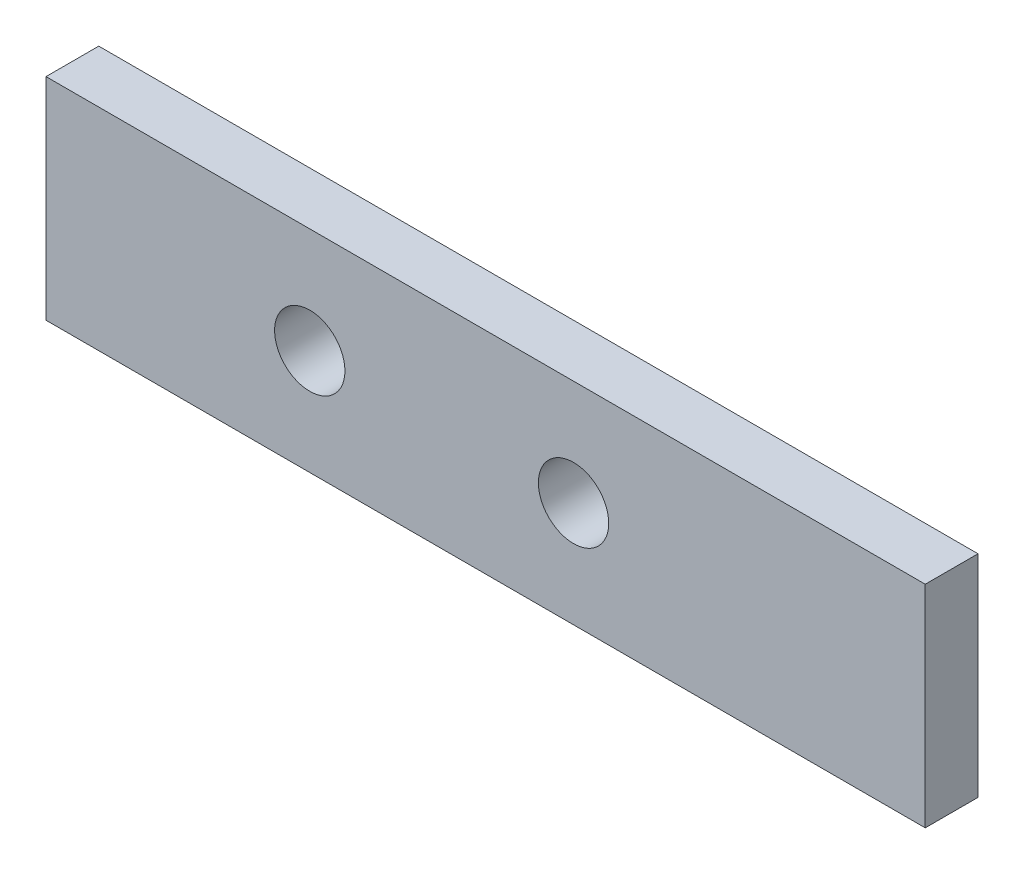
ISO-10303-21;
HEADER;
FILE_DESCRIPTION(('STEP AP214'),'2;1');
FILE_NAME('part.step','',(''),(''),'','','');
FILE_SCHEMA(('AUTOMOTIVE_DESIGN { 1 0 10303 214 1 1 1 1 }'));
ENDSEC;
DATA;
#1=APPLICATION_CONTEXT('core data for automotive mechanical design processes');
#2=APPLICATION_PROTOCOL_DEFINITION('international standard','automotive_design',2000,#1);
#3=PRODUCT_CONTEXT('',#1,'mechanical');
#4=PRODUCT('Part','Part','',(#3));
#5=PRODUCT_RELATED_PRODUCT_CATEGORY('part','',(#4));
#6=PRODUCT_DEFINITION_FORMATION('','',#4);
#7=PRODUCT_DEFINITION_CONTEXT('part definition',#1,'design');
#8=PRODUCT_DEFINITION('design','',#6,#7);
#9=PRODUCT_DEFINITION_SHAPE('','',#8);
#10=(LENGTH_UNIT() NAMED_UNIT(*) SI_UNIT(.MILLI.,.METRE.));
#11=(NAMED_UNIT(*) PLANE_ANGLE_UNIT() SI_UNIT($,.RADIAN.));
#12=(NAMED_UNIT(*) SI_UNIT($,.STERADIAN.) SOLID_ANGLE_UNIT());
#13=UNCERTAINTY_MEASURE_WITH_UNIT(LENGTH_MEASURE(1.E-05),#10,'distance_accuracy_value','');
#14=(GEOMETRIC_REPRESENTATION_CONTEXT(3) GLOBAL_UNCERTAINTY_ASSIGNED_CONTEXT((#13)) GLOBAL_UNIT_ASSIGNED_CONTEXT((#10,
#11,#12)) REPRESENTATION_CONTEXT('',''));
#15=CARTESIAN_POINT('',(0.,0.,0.));
#16=DIRECTION('',(0.,0.,1.));
#17=DIRECTION('',(1.,0.,0.));
#18=AXIS2_PLACEMENT_3D('',#15,#16,#17);
#19=CARTESIAN_POINT('',(250.,-30.,7.5));
#20=DIRECTION('',(0.,1.,0.));
#21=DIRECTION('',(0.,0.,1.));
#22=AXIS2_PLACEMENT_3D('',#19,#20,#21);
#23=PLANE('',#22);
#24=DIRECTION('',(0.,0.,-1.));
#25=VECTOR('',#24,1.);
#26=CARTESIAN_POINT('',(0.,-30.,7.5));
#27=LINE('',#26,#25);
#28=CARTESIAN_POINT('',(0.,-30.,7.5));
#29=VERTEX_POINT('',#28);
#30=CARTESIAN_POINT('',(0.,-30.,-7.5));
#31=VERTEX_POINT('',#30);
#32=EDGE_CURVE('E117',#29,#31,#27,.T.);
#33=ORIENTED_EDGE('',*,*,#32,.T.);
#34=DIRECTION('',(-1.,0.,0.));
#35=VECTOR('',#34,1.);
#36=CARTESIAN_POINT('',(250.,-30.,-7.5));
#37=LINE('',#36,#35);
#38=CARTESIAN_POINT('',(250.,-30.,-7.5));
#39=VERTEX_POINT('',#38);
#40=EDGE_CURVE('E13',#39,#31,#37,.T.);
#41=ORIENTED_EDGE('',*,*,#40,.F.);
#42=DIRECTION('',(0.,0.,-1.));
#43=VECTOR('',#42,1.);
#44=CARTESIAN_POINT('',(250.,-30.,7.5));
#45=LINE('',#44,#43);
#46=CARTESIAN_POINT('',(250.,-30.,7.5));
#47=VERTEX_POINT('',#46);
#48=EDGE_CURVE('E104',#47,#39,#45,.T.);
#49=ORIENTED_EDGE('',*,*,#48,.F.);
#50=DIRECTION('',(-1.,0.,0.));
#51=VECTOR('',#50,1.);
#52=CARTESIAN_POINT('',(250.,-30.,7.5));
#53=LINE('',#52,#51);
#54=EDGE_CURVE('E112',#47,#29,#53,.T.);
#55=ORIENTED_EDGE('',*,*,#54,.T.);
#56=EDGE_LOOP('',(#33,#41,#49,#55));
#57=FACE_BOUND('',#56,.T.);
#58=ADVANCED_FACE('F53',(#57),#23,.F.);
#59=CARTESIAN_POINT('',(250.,-30.,-7.5));
#60=DIRECTION('',(0.,0.,1.));
#61=DIRECTION('',(1.,0.,0.));
#62=AXIS2_PLACEMENT_3D('',#59,#60,#61);
#63=PLANE('',#62);
#64=CARTESIAN_POINT('',(75.,0.,-7.5));
#65=DIRECTION('',(0.,0.,1.));
#66=DIRECTION('',(1.,0.,0.));
#67=AXIS2_PLACEMENT_3D('',#64,#65,#66);
#68=CIRCLE('',#67,9.99999999999999);
#69=CARTESIAN_POINT('',(85.,0.,-7.5));
#70=VERTEX_POINT('',#69);
#71=EDGE_CURVE('E141',#70,#70,#68,.T.);
#72=ORIENTED_EDGE('',*,*,#71,.T.);
#73=EDGE_LOOP('',(#72));
#74=FACE_BOUND('',#73,.T.);
#75=CARTESIAN_POINT('',(150.,0.,-7.5));
#76=DIRECTION('',(0.,0.,1.));
#77=DIRECTION('',(1.,0.,0.));
#78=AXIS2_PLACEMENT_3D('',#75,#76,#77);
#79=CIRCLE('',#78,10.);
#80=CARTESIAN_POINT('',(160.,0.,-7.5));
#81=VERTEX_POINT('',#80);
#82=EDGE_CURVE('E133',#81,#81,#79,.T.);
#83=ORIENTED_EDGE('',*,*,#82,.T.);
#84=EDGE_LOOP('',(#83));
#85=FACE_BOUND('',#84,.T.);
#86=DIRECTION('',(0.,1.,0.));
#87=VECTOR('',#86,1.);
#88=CARTESIAN_POINT('',(0.,-30.,-7.5));
#89=LINE('',#88,#87);
#90=CARTESIAN_POINT('',(0.,30.,-7.5));
#91=VERTEX_POINT('',#90);
#92=EDGE_CURVE('E108',#31,#91,#89,.T.);
#93=ORIENTED_EDGE('',*,*,#92,.T.);
#94=DIRECTION('',(-1.,0.,0.));
#95=VECTOR('',#94,1.);
#96=CARTESIAN_POINT('',(250.,30.,-7.5));
#97=LINE('',#96,#95);
#98=CARTESIAN_POINT('',(250.,30.,-7.5));
#99=VERTEX_POINT('',#98);
#100=EDGE_CURVE('E61',#99,#91,#97,.T.);
#101=ORIENTED_EDGE('',*,*,#100,.F.);
#102=DIRECTION('',(0.,1.,0.));
#103=VECTOR('',#102,1.);
#104=CARTESIAN_POINT('',(250.,-30.,-7.5));
#105=LINE('',#104,#103);
#106=EDGE_CURVE('E99',#39,#99,#105,.T.);
#107=ORIENTED_EDGE('',*,*,#106,.F.);
#108=ORIENTED_EDGE('',*,*,#40,.T.);
#109=EDGE_LOOP('',(#93,#101,#107,#108));
#110=FACE_BOUND('',#109,.T.);
#111=ADVANCED_FACE('F107',(#74,#85,#110),#63,.F.);
#112=CARTESIAN_POINT('',(250.,30.,7.5));
#113=DIRECTION('',(0.,-1.,0.));
#114=DIRECTION('',(0.,0.,-1.));
#115=AXIS2_PLACEMENT_3D('',#112,#113,#114);
#116=PLANE('',#115);
#117=DIRECTION('',(0.,0.,1.));
#118=VECTOR('',#117,1.);
#119=CARTESIAN_POINT('',(0.,30.,7.5));
#120=LINE('',#119,#118);
#121=CARTESIAN_POINT('',(0.,30.,7.5));
#122=VERTEX_POINT('',#121);
#123=EDGE_CURVE('E86',#91,#122,#120,.T.);
#124=ORIENTED_EDGE('',*,*,#123,.T.);
#125=DIRECTION('',(-1.,0.,0.));
#126=VECTOR('',#125,1.);
#127=CARTESIAN_POINT('',(250.,30.,7.5));
#128=LINE('',#127,#126);
#129=CARTESIAN_POINT('',(250.,30.,7.5));
#130=VERTEX_POINT('',#129);
#131=EDGE_CURVE('E109',#130,#122,#128,.T.);
#132=ORIENTED_EDGE('',*,*,#131,.F.);
#133=DIRECTION('',(0.,0.,1.));
#134=VECTOR('',#133,1.);
#135=CARTESIAN_POINT('',(250.,30.,7.5));
#136=LINE('',#135,#134);
#137=EDGE_CURVE('E102',#99,#130,#136,.T.);
#138=ORIENTED_EDGE('',*,*,#137,.F.);
#139=ORIENTED_EDGE('',*,*,#100,.T.);
#140=EDGE_LOOP('',(#124,#132,#138,#139));
#141=FACE_BOUND('',#140,.T.);
#142=ADVANCED_FACE('F110',(#141),#116,.F.);
#143=CARTESIAN_POINT('',(250.,-30.,7.5));
#144=DIRECTION('',(0.,0.,-1.));
#145=DIRECTION('',(-1.,0.,0.));
#146=AXIS2_PLACEMENT_3D('',#143,#144,#145);
#147=PLANE('',#146);
#148=CARTESIAN_POINT('',(75.,0.,7.5));
#149=DIRECTION('',(0.,0.,1.));
#150=DIRECTION('',(1.,0.,0.));
#151=AXIS2_PLACEMENT_3D('',#148,#149,#150);
#152=CIRCLE('',#151,9.99999999999999);
#153=CARTESIAN_POINT('',(85.,0.,7.5));
#154=VERTEX_POINT('',#153);
#155=EDGE_CURVE('E144',#154,#154,#152,.T.);
#156=ORIENTED_EDGE('',*,*,#155,.F.);
#157=EDGE_LOOP('',(#156));
#158=FACE_BOUND('',#157,.T.);
#159=CARTESIAN_POINT('',(150.,0.,7.5));
#160=DIRECTION('',(0.,0.,1.));
#161=DIRECTION('',(1.,0.,0.));
#162=AXIS2_PLACEMENT_3D('',#159,#160,#161);
#163=CIRCLE('',#162,10.);
#164=CARTESIAN_POINT('',(160.,0.,7.5));
#165=VERTEX_POINT('',#164);
#166=EDGE_CURVE('E136',#165,#165,#163,.T.);
#167=ORIENTED_EDGE('',*,*,#166,.F.);
#168=EDGE_LOOP('',(#167));
#169=FACE_BOUND('',#168,.T.);
#170=DIRECTION('',(0.,-1.,0.));
#171=VECTOR('',#170,1.);
#172=CARTESIAN_POINT('',(0.,-30.,7.5));
#173=LINE('',#172,#171);
#174=EDGE_CURVE('E92',#122,#29,#173,.T.);
#175=ORIENTED_EDGE('',*,*,#174,.T.);
#176=ORIENTED_EDGE('',*,*,#54,.F.);
#177=DIRECTION('',(0.,-1.,0.));
#178=VECTOR('',#177,1.);
#179=CARTESIAN_POINT('',(250.,-30.,7.5));
#180=LINE('',#179,#178);
#181=EDGE_CURVE('E69',#130,#47,#180,.T.);
#182=ORIENTED_EDGE('',*,*,#181,.F.);
#183=ORIENTED_EDGE('',*,*,#131,.T.);
#184=EDGE_LOOP('',(#175,#176,#182,#183));
#185=FACE_BOUND('',#184,.T.);
#186=ADVANCED_FACE('F128',(#158,#169,#185),#147,.F.);
#187=CARTESIAN_POINT('',(250.,-30.,-7.5));
#188=DIRECTION('',(1.,0.,0.));
#189=DIRECTION('',(0.,0.,-1.));
#190=AXIS2_PLACEMENT_3D('',#187,#188,#189);
#191=PLANE('',#190);
#192=ORIENTED_EDGE('',*,*,#48,.T.);
#193=ORIENTED_EDGE('',*,*,#106,.T.);
#194=ORIENTED_EDGE('',*,*,#137,.T.);
#195=ORIENTED_EDGE('',*,*,#181,.T.);
#196=EDGE_LOOP('',(#192,#193,#194,#195));
#197=FACE_BOUND('',#196,.T.);
#198=ADVANCED_FACE('F100',(#197),#191,.T.);
#199=CARTESIAN_POINT('',(0.,-30.,-7.5));
#200=DIRECTION('',(1.,0.,0.));
#201=DIRECTION('',(0.,0.,-1.));
#202=AXIS2_PLACEMENT_3D('',#199,#200,#201);
#203=PLANE('',#202);
#204=ORIENTED_EDGE('',*,*,#32,.F.);
#205=ORIENTED_EDGE('',*,*,#174,.F.);
#206=ORIENTED_EDGE('',*,*,#123,.F.);
#207=ORIENTED_EDGE('',*,*,#92,.F.);
#208=EDGE_LOOP('',(#204,#205,#206,#207));
#209=FACE_BOUND('',#208,.T.);
#210=ADVANCED_FACE('F131',(#209),#203,.F.);
#211=CARTESIAN_POINT('',(150.,0.,-7.5));
#212=DIRECTION('',(0.,0.,1.));
#213=DIRECTION('',(1.,0.,0.));
#214=AXIS2_PLACEMENT_3D('',#211,#212,#213);
#215=CYLINDRICAL_SURFACE('',#214,10.);
#216=ORIENTED_EDGE('',*,*,#82,.F.);
#217=EDGE_LOOP('',(#216));
#218=FACE_BOUND('',#217,.T.);
#219=ORIENTED_EDGE('',*,*,#166,.T.);
#220=EDGE_LOOP('',(#219));
#221=FACE_BOUND('',#220,.T.);
#222=ADVANCED_FACE('F157',(#218,#221),#215,.F.);
#223=CARTESIAN_POINT('',(75.,0.,-7.5));
#224=DIRECTION('',(0.,0.,1.));
#225=DIRECTION('',(1.,0.,0.));
#226=AXIS2_PLACEMENT_3D('',#223,#224,#225);
#227=CYLINDRICAL_SURFACE('',#226,9.99999999999999);
#228=ORIENTED_EDGE('',*,*,#71,.F.);
#229=EDGE_LOOP('',(#228));
#230=FACE_BOUND('',#229,.T.);
#231=ORIENTED_EDGE('',*,*,#155,.T.);
#232=EDGE_LOOP('',(#231));
#233=FACE_BOUND('',#232,.T.);
#234=ADVANCED_FACE('F154',(#230,#233),#227,.F.);
#235=CLOSED_SHELL('',(#58,#111,#142,#186,#198,#210,#222,#234));
#236=MANIFOLD_SOLID_BREP('B2',#235);
#237=ADVANCED_BREP_SHAPE_REPRESENTATION('',(#18,#236),#14);
#238=SHAPE_DEFINITION_REPRESENTATION(#9,#237);
ENDSEC;
END-ISO-10303-21;
